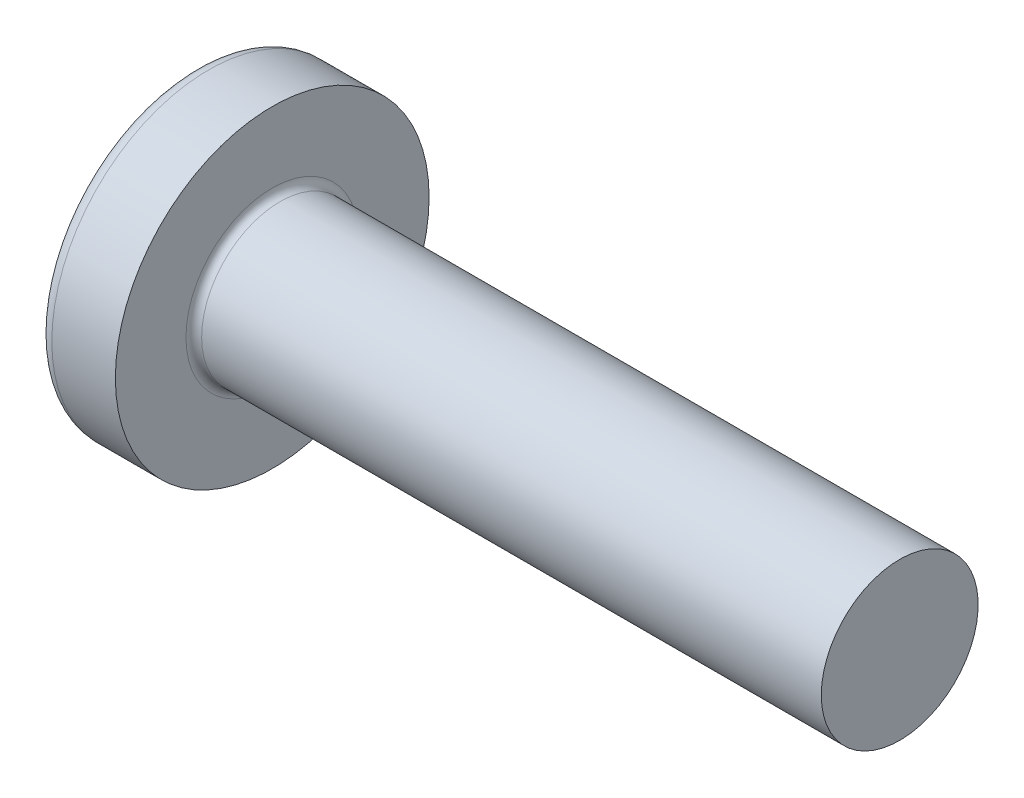
ISO-10303-21;
HEADER;
FILE_DESCRIPTION(('STEP AP214'),'2;1');
FILE_NAME('part.step','',(''),(''),'','','');
FILE_SCHEMA(('AUTOMOTIVE_DESIGN { 1 0 10303 214 1 1 1 1 }'));
ENDSEC;
DATA;
#1=APPLICATION_CONTEXT('core data for automotive mechanical design processes');
#2=APPLICATION_PROTOCOL_DEFINITION('international standard','automotive_design',2000,#1);
#3=PRODUCT_CONTEXT('',#1,'mechanical');
#4=PRODUCT('Part','Part','',(#3));
#5=PRODUCT_RELATED_PRODUCT_CATEGORY('part','',(#4));
#6=PRODUCT_DEFINITION_FORMATION('','',#4);
#7=PRODUCT_DEFINITION_CONTEXT('part definition',#1,'design');
#8=PRODUCT_DEFINITION('design','',#6,#7);
#9=PRODUCT_DEFINITION_SHAPE('','',#8);
#10=(LENGTH_UNIT() NAMED_UNIT(*) SI_UNIT(.MILLI.,.METRE.));
#11=(NAMED_UNIT(*) PLANE_ANGLE_UNIT() SI_UNIT($,.RADIAN.));
#12=(NAMED_UNIT(*) SI_UNIT($,.STERADIAN.) SOLID_ANGLE_UNIT());
#13=UNCERTAINTY_MEASURE_WITH_UNIT(LENGTH_MEASURE(1.E-05),#10,'distance_accuracy_value','');
#14=(GEOMETRIC_REPRESENTATION_CONTEXT(3) GLOBAL_UNCERTAINTY_ASSIGNED_CONTEXT((#13)) GLOBAL_UNIT_ASSIGNED_CONTEXT((#10,
#11,#12)) REPRESENTATION_CONTEXT('',''));
#15=CARTESIAN_POINT('',(0.,0.,0.));
#16=DIRECTION('',(0.,0.,1.));
#17=DIRECTION('',(1.,0.,0.));
#18=AXIS2_PLACEMENT_3D('',#15,#16,#17);
#19=CARTESIAN_POINT('',(3.2,0.,0.));
#20=DIRECTION('',(-1.,0.,0.));
#21=DIRECTION('',(0.,1.,0.));
#22=AXIS2_PLACEMENT_3D('',#19,#20,#21);
#23=SPHERICAL_SURFACE('',#22,3.2);
#24=CARTESIAN_POINT('',(0.646379599446113,0.,0.));
#25=DIRECTION('',(-1.,0.,0.));
#26=DIRECTION('',(0.,0.,1.));
#27=AXIS2_PLACEMENT_3D('',#24,#25,#26);
#28=CIRCLE('',#27,1.92847682119205);
#29=CARTESIAN_POINT('',(0.646379599446113,0.,1.92847682119205));
#30=VERTEX_POINT('',#29);
#31=EDGE_CURVE('E234',#30,#30,#28,.T.);
#32=ORIENTED_EDGE('',*,*,#31,.T.);
#33=EDGE_LOOP('',(#32));
#34=FACE_BOUND('',#33,.T.);
#35=CARTESIAN_POINT('',(0.0321614467928863,0.,0.));
#36=DIRECTION('',(1.,0.,0.));
#37=DIRECTION('',(0.,0.,-1.));
#38=AXIS2_PLACEMENT_3D('',#35,#36,#37);
#39=CIRCLE('',#38,0.452547125518057);
#40=CARTESIAN_POINT('',(0.0321614467928857,-0.239999999999999,-0.38366508938742));
#41=VERTEX_POINT('',#40);
#42=CARTESIAN_POINT('',(0.0321614467928861,-0.383665089387422,-0.24));
#43=VERTEX_POINT('',#42);
#44=EDGE_CURVE('E370',#41,#43,#39,.F.);
#45=ORIENTED_EDGE('',*,*,#44,.F.);
#46=CARTESIAN_POINT('',(3.2,-0.24,0.));
#47=DIRECTION('',(0.,1.,0.));
#48=DIRECTION('',(0.,0.,1.));
#49=AXIS2_PLACEMENT_3D('',#46,#47,#48);
#50=CIRCLE('',#49,3.19098730802866);
#51=CARTESIAN_POINT('',(0.160076670449441,-0.239999999999996,-0.970188718989376));
#52=VERTEX_POINT('',#51);
#53=EDGE_CURVE('E296',#52,#41,#50,.T.);
#54=ORIENTED_EDGE('',*,*,#53,.F.);
#55=CARTESIAN_POINT('',(2.98218770632418,0.,0.436863890831905));
#56=DIRECTION('',(0.446197800778958,0.,-0.89493436774996));
#57=DIRECTION('',(-0.89493436774996,0.,-0.446197800778958));
#58=AXIS2_PLACEMENT_3D('',#55,#56,#57);
#59=CIRCLE('',#58,3.16254766693103);
#60=CARTESIAN_POINT('',(0.160076670449441,0.240000000000003,-0.970188718989374));
#61=VERTEX_POINT('',#60);
#62=EDGE_CURVE('E268',#52,#61,#59,.T.);
#63=ORIENTED_EDGE('',*,*,#62,.T.);
#64=CARTESIAN_POINT('',(3.2,0.24,0.));
#65=DIRECTION('',(0.,-1.,0.));
#66=DIRECTION('',(0.,0.,-1.));
#67=AXIS2_PLACEMENT_3D('',#64,#65,#66);
#68=CIRCLE('',#67,3.19098730802866);
#69=CARTESIAN_POINT('',(0.0321614467928856,0.240000000000001,-0.383665089387418));
#70=VERTEX_POINT('',#69);
#71=EDGE_CURVE('E323',#70,#61,#68,.T.);
#72=ORIENTED_EDGE('',*,*,#71,.F.);
#73=CARTESIAN_POINT('',(0.0321614467928861,0.38366508938742,-0.24));
#74=VERTEX_POINT('',#73);
#75=EDGE_CURVE('E389',#74,#70,#39,.F.);
#76=ORIENTED_EDGE('',*,*,#75,.F.);
#77=CARTESIAN_POINT('',(3.2,0.,-0.24));
#78=DIRECTION('',(0.,0.,1.));
#79=DIRECTION('',(1.,0.,0.));
#80=AXIS2_PLACEMENT_3D('',#77,#78,#79);
#81=CIRCLE('',#80,3.19098730802866);
#82=CARTESIAN_POINT('',(0.160076670449441,0.970188718989374,-0.24));
#83=VERTEX_POINT('',#82);
#84=EDGE_CURVE('E262',#83,#74,#81,.T.);
#85=ORIENTED_EDGE('',*,*,#84,.F.);
#86=CARTESIAN_POINT('',(2.98218770632419,-0.436863890831905,0.));
#87=DIRECTION('',(0.446197800778958,0.89493436774996,0.));
#88=DIRECTION('',(-0.89493436774996,0.446197800778958,0.));
#89=AXIS2_PLACEMENT_3D('',#86,#87,#88);
#90=CIRCLE('',#89,3.16254766693103);
#91=CARTESIAN_POINT('',(0.160076670449442,0.970188718989374,0.24));
#92=VERTEX_POINT('',#91);
#93=EDGE_CURVE('E265',#83,#92,#90,.T.);
#94=ORIENTED_EDGE('',*,*,#93,.T.);
#95=CARTESIAN_POINT('',(3.2,0.,0.24));
#96=DIRECTION('',(0.,0.,-1.));
#97=DIRECTION('',(0.,1.,0.));
#98=AXIS2_PLACEMENT_3D('',#95,#96,#97);
#99=CIRCLE('',#98,3.19098730802866);
#100=CARTESIAN_POINT('',(0.0321614467928861,0.38366508938742,0.24));
#101=VERTEX_POINT('',#100);
#102=EDGE_CURVE('E258',#101,#92,#99,.T.);
#103=ORIENTED_EDGE('',*,*,#102,.F.);
#104=CARTESIAN_POINT('',(0.0321614467928857,0.239999999999999,0.38366508938742));
#105=VERTEX_POINT('',#104);
#106=EDGE_CURVE('E388',#105,#101,#39,.F.);
#107=ORIENTED_EDGE('',*,*,#106,.F.);
#108=CARTESIAN_POINT('',(0.160076670449441,0.239999999999997,0.970188718989375));
#109=VERTEX_POINT('',#108);
#110=EDGE_CURVE('E278',#109,#105,#68,.T.);
#111=ORIENTED_EDGE('',*,*,#110,.F.);
#112=CARTESIAN_POINT('',(2.98218770632418,0.,-0.436863890831904));
#113=DIRECTION('',(0.446197800778958,0.,0.89493436774996));
#114=DIRECTION('',(0.89493436774996,0.,-0.446197800778958));
#115=AXIS2_PLACEMENT_3D('',#112,#113,#114);
#116=CIRCLE('',#115,3.16254766693103);
#117=CARTESIAN_POINT('',(0.160076670449441,-0.240000000000003,0.970188718989374));
#118=VERTEX_POINT('',#117);
#119=EDGE_CURVE('E45',#109,#118,#116,.T.);
#120=ORIENTED_EDGE('',*,*,#119,.T.);
#121=CARTESIAN_POINT('',(0.0321614467928858,-0.240000000000001,0.383665089387418));
#122=VERTEX_POINT('',#121);
#123=EDGE_CURVE('E275',#122,#118,#50,.T.);
#124=ORIENTED_EDGE('',*,*,#123,.F.);
#125=CARTESIAN_POINT('',(0.0321614467928861,-0.383665089387422,0.24));
#126=VERTEX_POINT('',#125);
#127=EDGE_CURVE('E424',#126,#122,#39,.F.);
#128=ORIENTED_EDGE('',*,*,#127,.F.);
#129=CARTESIAN_POINT('',(0.160076670449441,-0.970188718989375,0.24));
#130=VERTEX_POINT('',#129);
#131=EDGE_CURVE('E259',#130,#126,#99,.T.);
#132=ORIENTED_EDGE('',*,*,#131,.F.);
#133=CARTESIAN_POINT('',(2.98218770632418,0.436863890831904,0.));
#134=DIRECTION('',(0.446197800778958,-0.89493436774996,0.));
#135=DIRECTION('',(0.89493436774996,0.446197800778958,0.));
#136=AXIS2_PLACEMENT_3D('',#133,#134,#135);
#137=CIRCLE('',#136,3.16254766693103);
#138=CARTESIAN_POINT('',(0.160076670449441,-0.970188718989375,-0.24));
#139=VERTEX_POINT('',#138);
#140=EDGE_CURVE('E255',#130,#139,#137,.T.);
#141=ORIENTED_EDGE('',*,*,#140,.T.);
#142=EDGE_CURVE('E60',#43,#139,#81,.T.);
#143=ORIENTED_EDGE('',*,*,#142,.F.);
#144=EDGE_LOOP('',(#45,#54,#63,#72,#76,#85,#94,#103,#107,#111,#120,#124,#128,#132,#141,#143));
#145=FACE_BOUND('',#144,.T.);
#146=ADVANCED_FACE('F32',(#34,#145),#23,.T.);
#147=CARTESIAN_POINT('',(1.42,0.342014140993248,-0.24));
#148=DIRECTION('',(0.,0.,1.));
#149=DIRECTION('',(1.,0.,0.));
#150=AXIS2_PLACEMENT_3D('',#147,#148,#149);
#151=PLANE('',#150);
#152=ORIENTED_EDGE('',*,*,#84,.T.);
#153=CARTESIAN_POINT('',(-0.626811087646333,0.437068483432734,-0.24));
#154=CARTESIAN_POINT('',(-0.489788496188268,0.426133650699674,-0.24));
#155=CARTESIAN_POINT('',(-0.35277275089666,0.415111501640762,-0.24));
#156=CARTESIAN_POINT('',(-0.078757882964478,0.392826208775377,-0.24));
#157=CARTESIAN_POINT('',(0.0582412392502161,0.381563059737591,-0.24));
#158=CARTESIAN_POINT('',(0.332213907654152,0.358729879929546,-0.24));
#159=CARTESIAN_POINT('',(0.469187453856035,0.347159849311357,-0.24));
#160=CARTESIAN_POINT('',(0.743097225439297,0.323608060039765,-0.24));
#161=CARTESIAN_POINT('',(0.880033451350377,0.311626307573655,-0.24));
#162=CARTESIAN_POINT('',(1.12503843743479,0.289667437089413,-0.24));
#163=CARTESIAN_POINT('',(1.23311691792,0.279799173776849,-0.24));
#164=CARTESIAN_POINT('',(1.4492267018282,0.259570129968442,-0.24));
#165=CARTESIAN_POINT('',(1.55725800577256,0.249209355061897,-0.24));
#166=CARTESIAN_POINT('',(1.77325939831777,0.227783788850472,-0.24));
#167=CARTESIAN_POINT('',(1.88122948205844,0.216718947894398,-0.24));
#168=CARTESIAN_POINT('',(2.04309848476113,0.199296215271932,-0.24));
#169=CARTESIAN_POINT('',(2.09704158415864,0.193350927204474,-0.24));
#170=CARTESIAN_POINT('',(2.20488609252136,0.181086542764125,-0.24));
#171=CARTESIAN_POINT('',(2.25878750075649,0.174767439988846,-0.24));
#172=CARTESIAN_POINT('',(2.31266102213859,0.168212174791089,-0.24));
#173=B_SPLINE_CURVE_WITH_KNOTS('',3,(#153,#154,#155,#156,#157,#158,#159,#160,#161,#162,#163,
#164,#165,#166,#167,#168,#169,#170,#171,#172),.UNSPECIFIED.,.F.,.F.,(4,2,2,2,2,2,2,2,2,4),(0.,
0.412374804430943,0.824758569256476,1.23714212973639,1.64951949568622,1.97510284899868,
2.30068250829037,2.62628515317116,2.78909323564388,2.95190410736571),.UNSPECIFIED.);
#174=CARTESIAN_POINT('',(1.42,0.262259890185289,-0.240000000000001));
#175=VERTEX_POINT('',#174);
#176=EDGE_CURVE('E410',#74,#175,#173,.T.);
#177=ORIENTED_EDGE('',*,*,#176,.T.);
#178=DIRECTION('',(0.,1.,0.));
#179=VECTOR('',#178,1.);
#180=CARTESIAN_POINT('',(1.42,-0.342014140993248,-0.24));
#181=LINE('',#180,#179);
#182=CARTESIAN_POINT('',(1.42,0.342014140993248,-0.24));
#183=VERTEX_POINT('',#182);
#184=EDGE_CURVE('E352',#175,#183,#181,.T.);
#185=ORIENTED_EDGE('',*,*,#184,.T.);
#186=DIRECTION('',(0.89493436774996,-0.446197800778958,0.));
#187=VECTOR('',#186,1.);
#188=CARTESIAN_POINT('',(0.,1.05,-0.24));
#189=LINE('',#188,#187);
#190=EDGE_CURVE('E235',#83,#183,#189,.T.);
#191=ORIENTED_EDGE('',*,*,#190,.F.);
#192=EDGE_LOOP('',(#152,#177,#185,#191));
#193=FACE_BOUND('',#192,.T.);
#194=ADVANCED_FACE('F190',(#193),#151,.T.);
#195=CARTESIAN_POINT('',(1.42,-0.342014140993248,-0.24));
#196=VERTEX_POINT('',#195);
#197=CARTESIAN_POINT('',(1.42,-0.262259890185289,-0.240000000000001));
#198=VERTEX_POINT('',#197);
#199=EDGE_CURVE('E243',#196,#198,#181,.T.);
#200=ORIENTED_EDGE('',*,*,#199,.T.);
#201=CARTESIAN_POINT('',(-0.626811087646333,-0.437068483432734,-0.24));
#202=CARTESIAN_POINT('',(-0.489788496188268,-0.426133650699674,-0.24));
#203=CARTESIAN_POINT('',(-0.35277275089666,-0.415111501640762,-0.24));
#204=CARTESIAN_POINT('',(-0.078757882964478,-0.392826208775377,-0.24));
#205=CARTESIAN_POINT('',(0.0582412392502161,-0.381563059737591,-0.24));
#206=CARTESIAN_POINT('',(0.332213907654152,-0.358729879929546,-0.24));
#207=CARTESIAN_POINT('',(0.469187453856035,-0.347159849311357,-0.24));
#208=CARTESIAN_POINT('',(0.743097225439297,-0.323608060039765,-0.24));
#209=CARTESIAN_POINT('',(0.880033451350377,-0.311626307573655,-0.24));
#210=CARTESIAN_POINT('',(1.12503843743479,-0.289667437089413,-0.24));
#211=CARTESIAN_POINT('',(1.23311691792,-0.279799173776849,-0.24));
#212=CARTESIAN_POINT('',(1.4492267018282,-0.259570129968442,-0.24));
#213=CARTESIAN_POINT('',(1.55725800577256,-0.249209355061897,-0.24));
#214=CARTESIAN_POINT('',(1.77325939831777,-0.227783788850472,-0.24));
#215=CARTESIAN_POINT('',(1.88122948205844,-0.216718947894398,-0.24));
#216=CARTESIAN_POINT('',(2.04309848476113,-0.199296215271932,-0.24));
#217=CARTESIAN_POINT('',(2.09704158415864,-0.193350927204474,-0.24));
#218=CARTESIAN_POINT('',(2.20488609252136,-0.181086542764125,-0.24));
#219=CARTESIAN_POINT('',(2.25878750075649,-0.174767439988846,-0.24));
#220=CARTESIAN_POINT('',(2.31266102213859,-0.168212174791089,-0.24));
#221=B_SPLINE_CURVE_WITH_KNOTS('',3,(#201,#202,#203,#204,#205,#206,#207,#208,#209,#210,#211,
#212,#213,#214,#215,#216,#217,#218,#219,#220),.UNSPECIFIED.,.F.,.F.,(4,2,2,2,2,2,2,2,2,4),(0.,
0.412374804430943,0.824758569256476,1.23714212973639,1.64951949568622,1.97510284899868,
2.30068250829037,2.62628515317116,2.78909323564388,2.95190410736571),.UNSPECIFIED.);
#222=EDGE_CURVE('E387',#198,#43,#221,.F.);
#223=ORIENTED_EDGE('',*,*,#222,.T.);
#224=ORIENTED_EDGE('',*,*,#142,.T.);
#225=DIRECTION('',(0.89493436774996,0.446197800778958,0.));
#226=VECTOR('',#225,1.);
#227=CARTESIAN_POINT('',(0.,-1.05,-0.24));
#228=LINE('',#227,#226);
#229=EDGE_CURVE('E326',#139,#196,#228,.T.);
#230=ORIENTED_EDGE('',*,*,#229,.T.);
#231=EDGE_LOOP('',(#200,#223,#224,#230));
#232=FACE_BOUND('',#231,.T.);
#233=ADVANCED_FACE('F196',(#232),#151,.T.);
#234=CARTESIAN_POINT('',(1.42,-0.342014140993248,0.24));
#235=DIRECTION('',(0.,0.,-1.));
#236=DIRECTION('',(0.,1.,0.));
#237=AXIS2_PLACEMENT_3D('',#234,#235,#236);
#238=PLANE('',#237);
#239=DIRECTION('',(0.,-1.,0.));
#240=VECTOR('',#239,1.);
#241=CARTESIAN_POINT('',(1.42,0.342014140993248,0.24));
#242=LINE('',#241,#240);
#243=CARTESIAN_POINT('',(1.42,0.342014140993248,0.24));
#244=VERTEX_POINT('',#243);
#245=CARTESIAN_POINT('',(1.42,0.262259890185289,0.240000000000001));
#246=VERTEX_POINT('',#245);
#247=EDGE_CURVE('E335',#244,#246,#242,.T.);
#248=ORIENTED_EDGE('',*,*,#247,.T.);
#249=CARTESIAN_POINT('',(-0.626811087646333,0.437068483432734,0.24));
#250=CARTESIAN_POINT('',(-0.489788496188268,0.426133650699674,0.24));
#251=CARTESIAN_POINT('',(-0.35277275089666,0.415111501640762,0.24));
#252=CARTESIAN_POINT('',(-0.078757882964478,0.392826208775377,0.24));
#253=CARTESIAN_POINT('',(0.0582412392502161,0.381563059737591,0.24));
#254=CARTESIAN_POINT('',(0.332213907654152,0.358729879929546,0.24));
#255=CARTESIAN_POINT('',(0.469187453856035,0.347159849311357,0.24));
#256=CARTESIAN_POINT('',(0.743097225439297,0.323608060039765,0.24));
#257=CARTESIAN_POINT('',(0.880033451350377,0.311626307573655,0.24));
#258=CARTESIAN_POINT('',(1.12503843743479,0.289667437089413,0.24));
#259=CARTESIAN_POINT('',(1.23311691792,0.279799173776849,0.24));
#260=CARTESIAN_POINT('',(1.4492267018282,0.259570129968442,0.24));
#261=CARTESIAN_POINT('',(1.55725800577256,0.249209355061897,0.24));
#262=CARTESIAN_POINT('',(1.77325939831777,0.227783788850472,0.24));
#263=CARTESIAN_POINT('',(1.88122948205844,0.216718947894398,0.24));
#264=CARTESIAN_POINT('',(2.04309848476113,0.199296215271932,0.24));
#265=CARTESIAN_POINT('',(2.09704158415864,0.193350927204474,0.24));
#266=CARTESIAN_POINT('',(2.20488609252136,0.181086542764125,0.24));
#267=CARTESIAN_POINT('',(2.25878750075649,0.174767439988846,0.24));
#268=CARTESIAN_POINT('',(2.31266102213859,0.168212174791089,0.24));
#269=B_SPLINE_CURVE_WITH_KNOTS('',3,(#249,#250,#251,#252,#253,#254,#255,#256,#257,#258,#259,
#260,#261,#262,#263,#264,#265,#266,#267,#268),.UNSPECIFIED.,.F.,.F.,(4,2,2,2,2,2,2,2,2,4),(0.,
0.412374804430943,0.824758569256476,1.23714212973639,1.64951949568622,1.97510284899868,
2.30068250829037,2.62628515317116,2.78909323564388,2.95190410736571),.UNSPECIFIED.);
#270=EDGE_CURVE('E668',#246,#101,#269,.F.);
#271=ORIENTED_EDGE('',*,*,#270,.T.);
#272=ORIENTED_EDGE('',*,*,#102,.T.);
#273=DIRECTION('',(0.89493436774996,-0.446197800778958,0.));
#274=VECTOR('',#273,1.);
#275=CARTESIAN_POINT('',(0.,1.05,0.24));
#276=LINE('',#275,#274);
#277=EDGE_CURVE('E240',#92,#244,#276,.T.);
#278=ORIENTED_EDGE('',*,*,#277,.T.);
#279=EDGE_LOOP('',(#248,#271,#272,#278));
#280=FACE_BOUND('',#279,.T.);
#281=ADVANCED_FACE('F406',(#280),#238,.T.);
#282=ORIENTED_EDGE('',*,*,#131,.T.);
#283=CARTESIAN_POINT('',(-0.62681108769363,-0.437068483436507,0.24));
#284=CARTESIAN_POINT('',(-0.489788496230297,-0.426133650703048,0.24));
#285=CARTESIAN_POINT('',(-0.352772750933422,-0.415111501643733,0.24));
#286=CARTESIAN_POINT('',(-0.078757882990706,-0.392826208777529,0.24));
#287=CARTESIAN_POINT('',(0.0582412392292549,-0.381563059739326,0.24));
#288=CARTESIAN_POINT('',(0.332213907649304,-0.358729879929962,0.24));
#289=CARTESIAN_POINT('',(0.46918745386203,-0.347159849310859,0.24));
#290=CARTESIAN_POINT('',(0.743097225466975,-0.323608060037368,0.24));
#291=CARTESIAN_POINT('',(0.880033451388893,-0.311626307570274,0.24));
#292=CARTESIAN_POINT('',(1.12503843748414,-0.289667437084935,0.24));
#293=CARTESIAN_POINT('',(1.23311691796934,-0.279799173772307,0.24));
#294=CARTESIAN_POINT('',(1.44922670187753,-0.259570129963748,0.24));
#295=CARTESIAN_POINT('',(1.55725800582188,-0.249209355057115,0.24));
#296=CARTESIAN_POINT('',(1.77325939836707,-0.227783788845471,0.24));
#297=CARTESIAN_POINT('',(1.88122948210773,-0.216718947889267,0.24));
#298=CARTESIAN_POINT('',(2.0430984848104,-0.199296215266543,0.24));
#299=CARTESIAN_POINT('',(2.0970415842079,-0.193350927198989,0.24));
#300=CARTESIAN_POINT('',(2.20488609257059,-0.181086542758414,0.24));
#301=CARTESIAN_POINT('',(2.25878750080571,-0.174767439983005,0.24));
#302=CARTESIAN_POINT('',(2.31266102218779,-0.168212174785095,0.24));
#303=B_SPLINE_CURVE_WITH_KNOTS('',3,(#283,#284,#285,#286,#287,#288,#289,#290,#291,#292,#293,
#294,#295,#296,#297,#298,#299,#300,#301,#302),.UNSPECIFIED.,.F.,.F.,(4,2,2,2,2,2,2,2,2,4),(0.,
0.41237480444679,0.824758569288173,1.23714212980074,1.64951949578321,1.97510284909568,
2.30068250838736,2.62628515326816,2.78909323574088,2.95190410746272),.UNSPECIFIED.);
#304=CARTESIAN_POINT('',(1.42,-0.262259890185289,0.240000000000001));
#305=VERTEX_POINT('',#304);
#306=EDGE_CURVE('E425',#126,#305,#303,.T.);
#307=ORIENTED_EDGE('',*,*,#306,.T.);
#308=CARTESIAN_POINT('',(1.42,-0.342014140993248,0.24));
#309=VERTEX_POINT('',#308);
#310=EDGE_CURVE('E337',#305,#309,#242,.T.);
#311=ORIENTED_EDGE('',*,*,#310,.T.);
#312=DIRECTION('',(0.89493436774996,0.446197800778958,0.));
#313=VECTOR('',#312,1.);
#314=CARTESIAN_POINT('',(0.,-1.05,0.24));
#315=LINE('',#314,#313);
#316=EDGE_CURVE('E328',#130,#309,#315,.T.);
#317=ORIENTED_EDGE('',*,*,#316,.F.);
#318=EDGE_LOOP('',(#282,#307,#311,#317));
#319=FACE_BOUND('',#318,.T.);
#320=ADVANCED_FACE('F516',(#319),#238,.T.);
#321=CARTESIAN_POINT('',(1.42,0.342014140993248,0.24));
#322=DIRECTION('',(0.446197800778958,0.89493436774996,0.));
#323=DIRECTION('',(-0.89493436774996,0.446197800778958,0.));
#324=AXIS2_PLACEMENT_3D('',#321,#322,#323);
#325=PLANE('',#324);
#326=CARTESIAN_POINT('',(2.01772939130752,0.0439972701774458,0.));
#327=DIRECTION('',(0.446197800778958,0.89493436774996,0.));
#328=DIRECTION('',(-0.89493436774996,0.446197800778958,0.));
#329=AXIS2_PLACEMENT_3D('',#326,#327,#328);
#330=ELLIPSE('',#329,0.703057452800713,0.310602024247227);
#331=CARTESIAN_POINT('',(1.42,0.342014140993249,0.0969875113643495));
#332=VERTEX_POINT('',#331);
#333=CARTESIAN_POINT('',(1.42,0.342014140993249,-0.0969875113643495));
#334=VERTEX_POINT('',#333);
#335=EDGE_CURVE('E301',#332,#334,#330,.F.);
#336=ORIENTED_EDGE('',*,*,#335,.F.);
#337=DIRECTION('',(0.,0.,-1.));
#338=VECTOR('',#337,1.);
#339=CARTESIAN_POINT('',(1.42,0.342014140993248,0.24));
#340=LINE('',#339,#338);
#341=EDGE_CURVE('E338',#244,#332,#340,.T.);
#342=ORIENTED_EDGE('',*,*,#341,.F.);
#343=ORIENTED_EDGE('',*,*,#277,.F.);
#344=ORIENTED_EDGE('',*,*,#93,.F.);
#345=ORIENTED_EDGE('',*,*,#190,.T.);
#346=EDGE_CURVE('E340',#334,#183,#340,.T.);
#347=ORIENTED_EDGE('',*,*,#346,.F.);
#348=EDGE_LOOP('',(#336,#342,#343,#344,#345,#347));
#349=FACE_BOUND('',#348,.T.);
#350=ADVANCED_FACE('F404',(#349),#325,.F.);
#351=CARTESIAN_POINT('',(0.,-1.05,-0.24));
#352=DIRECTION('',(0.446197800778958,-0.89493436774996,0.));
#353=DIRECTION('',(0.89493436774996,0.446197800778958,0.));
#354=AXIS2_PLACEMENT_3D('',#351,#352,#353);
#355=PLANE('',#354);
#356=CARTESIAN_POINT('',(2.01772939130752,-0.0439972701774458,0.));
#357=DIRECTION('',(0.446197800778958,-0.89493436774996,0.));
#358=DIRECTION('',(-0.89493436774996,-0.446197800778958,0.));
#359=AXIS2_PLACEMENT_3D('',#356,#357,#358);
#360=ELLIPSE('',#359,0.703057452800713,0.310602024247227);
#361=CARTESIAN_POINT('',(1.42,-0.342014140993249,-0.0969875113643494));
#362=VERTEX_POINT('',#361);
#363=CARTESIAN_POINT('',(1.42,-0.342014140993249,0.0969875113643493));
#364=VERTEX_POINT('',#363);
#365=EDGE_CURVE('E670',#362,#364,#360,.F.);
#366=ORIENTED_EDGE('',*,*,#365,.F.);
#367=DIRECTION('',(0.,0.,1.));
#368=VECTOR('',#367,1.);
#369=CARTESIAN_POINT('',(1.42,-0.342014140993248,-0.24));
#370=LINE('',#369,#368);
#371=EDGE_CURVE('E331',#196,#362,#370,.T.);
#372=ORIENTED_EDGE('',*,*,#371,.F.);
#373=ORIENTED_EDGE('',*,*,#229,.F.);
#374=ORIENTED_EDGE('',*,*,#140,.F.);
#375=ORIENTED_EDGE('',*,*,#316,.T.);
#376=EDGE_CURVE('E334',#364,#309,#370,.T.);
#377=ORIENTED_EDGE('',*,*,#376,.F.);
#378=EDGE_LOOP('',(#366,#372,#373,#374,#375,#377));
#379=FACE_BOUND('',#378,.T.);
#380=ADVANCED_FACE('F503',(#379),#355,.F.);
#381=CARTESIAN_POINT('',(1.42,0.342014140993248,-0.24));
#382=DIRECTION('',(-1.,0.,0.));
#383=DIRECTION('',(0.,0.,1.));
#384=AXIS2_PLACEMENT_3D('',#381,#382,#383);
#385=PLANE('',#384);
#386=DIRECTION('',(0.,1.,0.));
#387=VECTOR('',#386,1.);
#388=CARTESIAN_POINT('',(1.42,-0.240000000000001,0.342014140993247));
#389=LINE('',#388,#387);
#390=CARTESIAN_POINT('',(1.42,-0.240000000000001,0.342014140993247));
#391=VERTEX_POINT('',#390);
#392=CARTESIAN_POINT('',(1.42,-0.0969875113643545,0.342014140993248));
#393=VERTEX_POINT('',#392);
#394=EDGE_CURVE('E316',#391,#393,#389,.T.);
#395=ORIENTED_EDGE('',*,*,#394,.T.);
#396=CARTESIAN_POINT('',(1.42,0.,0.));
#397=DIRECTION('',(-1.,0.,0.));
#398=DIRECTION('',(0.,0.,1.));
#399=AXIS2_PLACEMENT_3D('',#396,#397,#398);
#400=CIRCLE('',#399,0.3555);
#401=CARTESIAN_POINT('',(1.42,-0.240000000000001,0.262259890185289));
#402=VERTEX_POINT('',#401);
#403=EDGE_CURVE('E696',#402,#393,#400,.T.);
#404=ORIENTED_EDGE('',*,*,#403,.F.);
#405=DIRECTION('',(0.,0.,-1.));
#406=VECTOR('',#405,1.);
#407=CARTESIAN_POINT('',(1.42,-0.240000000000001,0.342014140993247));
#408=LINE('',#407,#406);
#409=EDGE_CURVE('E312',#391,#402,#408,.T.);
#410=ORIENTED_EDGE('',*,*,#409,.F.);
#411=EDGE_LOOP('',(#395,#404,#410));
#412=FACE_BOUND('',#411,.T.);
#413=ADVANCED_FACE('F460',(#412),#385,.T.);
#414=ORIENTED_EDGE('',*,*,#310,.F.);
#415=EDGE_CURVE('E701',#364,#305,#400,.T.);
#416=ORIENTED_EDGE('',*,*,#415,.F.);
#417=ORIENTED_EDGE('',*,*,#376,.T.);
#418=EDGE_LOOP('',(#414,#416,#417));
#419=FACE_BOUND('',#418,.T.);
#420=ADVANCED_FACE('F490',(#419),#385,.T.);
#421=ORIENTED_EDGE('',*,*,#371,.T.);
#422=EDGE_CURVE('E381',#198,#362,#400,.T.);
#423=ORIENTED_EDGE('',*,*,#422,.F.);
#424=ORIENTED_EDGE('',*,*,#199,.F.);
#425=EDGE_LOOP('',(#421,#423,#424));
#426=FACE_BOUND('',#425,.T.);
#427=ADVANCED_FACE('F484',(#426),#385,.T.);
#428=CARTESIAN_POINT('',(1.42,-0.239999999999999,-0.262259890185288));
#429=VERTEX_POINT('',#428);
#430=CARTESIAN_POINT('',(1.42,-0.239999999999999,-0.342014140993249));
#431=VERTEX_POINT('',#430);
#432=EDGE_CURVE('E315',#429,#431,#408,.T.);
#433=ORIENTED_EDGE('',*,*,#432,.F.);
#434=CARTESIAN_POINT('',(1.42,-0.0969875113643523,-0.342014140993248));
#435=VERTEX_POINT('',#434);
#436=EDGE_CURVE('E52',#435,#429,#400,.T.);
#437=ORIENTED_EDGE('',*,*,#436,.F.);
#438=DIRECTION('',(0.,-1.,0.));
#439=VECTOR('',#438,1.);
#440=CARTESIAN_POINT('',(1.42,0.240000000000001,-0.342014140993247));
#441=LINE('',#440,#439);
#442=EDGE_CURVE('E311',#435,#431,#441,.T.);
#443=ORIENTED_EDGE('',*,*,#442,.T.);
#444=EDGE_LOOP('',(#433,#437,#443));
#445=FACE_BOUND('',#444,.T.);
#446=ADVANCED_FACE('F376',(#445),#385,.T.);
#447=CARTESIAN_POINT('',(1.42,0.240000000000001,-0.342014140993247));
#448=VERTEX_POINT('',#447);
#449=CARTESIAN_POINT('',(1.42,0.0969875113643547,-0.342014140993248));
#450=VERTEX_POINT('',#449);
#451=EDGE_CURVE('E308',#448,#450,#441,.T.);
#452=ORIENTED_EDGE('',*,*,#451,.T.);
#453=CARTESIAN_POINT('',(1.42,0.240000000000001,-0.262259890185289));
#454=VERTEX_POINT('',#453);
#455=EDGE_CURVE('E380',#454,#450,#400,.T.);
#456=ORIENTED_EDGE('',*,*,#455,.F.);
#457=DIRECTION('',(0.,0.,1.));
#458=VECTOR('',#457,1.);
#459=CARTESIAN_POINT('',(1.42,0.240000000000001,-0.342014140993247));
#460=LINE('',#459,#458);
#461=EDGE_CURVE('E320',#448,#454,#460,.T.);
#462=ORIENTED_EDGE('',*,*,#461,.F.);
#463=EDGE_LOOP('',(#452,#456,#462));
#464=FACE_BOUND('',#463,.T.);
#465=ADVANCED_FACE('F472',(#464),#385,.T.);
#466=ORIENTED_EDGE('',*,*,#184,.F.);
#467=EDGE_CURVE('E685',#334,#175,#400,.T.);
#468=ORIENTED_EDGE('',*,*,#467,.F.);
#469=ORIENTED_EDGE('',*,*,#346,.T.);
#470=EDGE_LOOP('',(#466,#468,#469));
#471=FACE_BOUND('',#470,.T.);
#472=ADVANCED_FACE('F466',(#471),#385,.T.);
#473=ORIENTED_EDGE('',*,*,#341,.T.);
#474=EDGE_CURVE('E687',#246,#332,#400,.T.);
#475=ORIENTED_EDGE('',*,*,#474,.F.);
#476=ORIENTED_EDGE('',*,*,#247,.F.);
#477=EDGE_LOOP('',(#473,#475,#476));
#478=FACE_BOUND('',#477,.T.);
#479=ADVANCED_FACE('F458',(#478),#385,.T.);
#480=CARTESIAN_POINT('',(1.42,0.239999999999999,0.26225989018529));
#481=VERTEX_POINT('',#480);
#482=CARTESIAN_POINT('',(1.42,0.239999999999999,0.342014140993249));
#483=VERTEX_POINT('',#482);
#484=EDGE_CURVE('E293',#481,#483,#460,.T.);
#485=ORIENTED_EDGE('',*,*,#484,.F.);
#486=CARTESIAN_POINT('',(1.42,0.0969875113643521,0.342014140993249));
#487=VERTEX_POINT('',#486);
#488=EDGE_CURVE('E382',#487,#481,#400,.T.);
#489=ORIENTED_EDGE('',*,*,#488,.F.);
#490=EDGE_CURVE('E319',#487,#483,#389,.T.);
#491=ORIENTED_EDGE('',*,*,#490,.T.);
#492=EDGE_LOOP('',(#485,#489,#491));
#493=FACE_BOUND('',#492,.T.);
#494=ADVANCED_FACE('F452',(#493),#385,.T.);
#495=CARTESIAN_POINT('',(1.42,0.239999999999999,0.342014140993249));
#496=DIRECTION('',(0.,-1.,0.));
#497=DIRECTION('',(1.,0.,0.));
#498=AXIS2_PLACEMENT_3D('',#495,#496,#497);
#499=PLANE('',#498);
#500=ORIENTED_EDGE('',*,*,#110,.T.);
#501=CARTESIAN_POINT('',(-0.626811087646333,0.239999999999998,0.437068483432735));
#502=CARTESIAN_POINT('',(-0.489788496188268,0.239999999999999,0.426133650699675));
#503=CARTESIAN_POINT('',(-0.35277275089666,0.239999999999999,0.415111501640762));
#504=CARTESIAN_POINT('',(-0.0787578829644782,0.239999999999999,0.392826208775378));
#505=CARTESIAN_POINT('',(0.0582412392502159,0.239999999999999,0.381563059737592));
#506=CARTESIAN_POINT('',(0.332213907654153,0.239999999999999,0.358729879929547));
#507=CARTESIAN_POINT('',(0.469187453856035,0.239999999999999,0.347159849311358));
#508=CARTESIAN_POINT('',(0.743097225439297,0.239999999999999,0.323608060039766));
#509=CARTESIAN_POINT('',(0.880033451350377,0.239999999999999,0.311626307573656));
#510=CARTESIAN_POINT('',(1.12503843743479,0.239999999999999,0.289667437089414));
#511=CARTESIAN_POINT('',(1.23311691792,0.239999999999999,0.279799173776849));
#512=CARTESIAN_POINT('',(1.4492267018282,0.239999999999999,0.259570129968443));
#513=CARTESIAN_POINT('',(1.55725800577256,0.239999999999999,0.249209355061898));
#514=CARTESIAN_POINT('',(1.77325939831777,0.239999999999999,0.227783788850473));
#515=CARTESIAN_POINT('',(1.88122948205844,0.239999999999999,0.216718947894399));
#516=CARTESIAN_POINT('',(2.04309848476113,0.239999999999999,0.199296215271933));
#517=CARTESIAN_POINT('',(2.09704158415864,0.239999999999999,0.193350927204475));
#518=CARTESIAN_POINT('',(2.20488609252136,0.239999999999999,0.181086542764126));
#519=CARTESIAN_POINT('',(2.25878750075649,0.239999999999999,0.174767439988847));
#520=CARTESIAN_POINT('',(2.31266102213859,0.239999999999999,0.16821217479109));
#521=B_SPLINE_CURVE_WITH_KNOTS('',3,(#501,#502,#503,#504,#505,#506,#507,#508,#509,#510,#511,
#512,#513,#514,#515,#516,#517,#518,#519,#520),.UNSPECIFIED.,.F.,.F.,(4,2,2,2,2,2,2,2,2,4),(0.,
0.412374804430942,0.824758569256476,1.23714212973639,1.64951949568622,1.97510284899868,
2.30068250829037,2.62628515317116,2.78909323564388,2.95190410736571),.UNSPECIFIED.);
#522=EDGE_CURVE('E667',#105,#481,#521,.T.);
#523=ORIENTED_EDGE('',*,*,#522,.T.);
#524=ORIENTED_EDGE('',*,*,#484,.T.);
#525=DIRECTION('',(0.89493436774996,0.,-0.446197800778958));
#526=VECTOR('',#525,1.);
#527=CARTESIAN_POINT('',(0.,0.239999999999996,1.05));
#528=LINE('',#527,#526);
#529=EDGE_CURVE('E286',#109,#483,#528,.T.);
#530=ORIENTED_EDGE('',*,*,#529,.F.);
#531=EDGE_LOOP('',(#500,#523,#524,#530));
#532=FACE_BOUND('',#531,.T.);
#533=ADVANCED_FACE('F290',(#532),#499,.T.);
#534=CARTESIAN_POINT('',(1.42,-0.239999999999999,-0.342014140993249));
#535=DIRECTION('',(0.,1.,0.));
#536=DIRECTION('',(0.,0.,1.));
#537=AXIS2_PLACEMENT_3D('',#534,#535,#536);
#538=PLANE('',#537);
#539=ORIENTED_EDGE('',*,*,#409,.T.);
#540=CARTESIAN_POINT('',(-0.626811087646334,-0.240000000000002,0.437068483432733));
#541=CARTESIAN_POINT('',(-0.489788496188268,-0.240000000000001,0.426133650699673));
#542=CARTESIAN_POINT('',(-0.35277275089666,-0.240000000000001,0.415111501640761));
#543=CARTESIAN_POINT('',(-0.0787578829644779,-0.240000000000001,0.392826208775376));
#544=CARTESIAN_POINT('',(0.0582412392502161,-0.240000000000001,0.38156305973759));
#545=CARTESIAN_POINT('',(0.332213907654152,-0.240000000000001,0.358729879929545));
#546=CARTESIAN_POINT('',(0.469187453856034,-0.240000000000001,0.347159849311357));
#547=CARTESIAN_POINT('',(0.743097225439297,-0.240000000000001,0.323608060039764));
#548=CARTESIAN_POINT('',(0.880033451350377,-0.240000000000001,0.311626307573654));
#549=CARTESIAN_POINT('',(1.12503843743479,-0.240000000000001,0.289667437089413));
#550=CARTESIAN_POINT('',(1.23311691792,-0.240000000000001,0.279799173776848));
#551=CARTESIAN_POINT('',(1.4492267018282,-0.240000000000001,0.259570129968441));
#552=CARTESIAN_POINT('',(1.55725800577256,-0.240000000000001,0.249209355061896));
#553=CARTESIAN_POINT('',(1.77325939831777,-0.240000000000001,0.227783788850472));
#554=CARTESIAN_POINT('',(1.88122948205844,-0.240000000000001,0.216718947894398));
#555=CARTESIAN_POINT('',(2.04309848476113,-0.240000000000001,0.199296215271931));
#556=CARTESIAN_POINT('',(2.09704158415864,-0.240000000000001,0.193350927204474));
#557=CARTESIAN_POINT('',(2.20488609252136,-0.240000000000001,0.181086542764124));
#558=CARTESIAN_POINT('',(2.25878750075649,-0.240000000000001,0.174767439988845));
#559=CARTESIAN_POINT('',(2.31266102213859,-0.240000000000001,0.168212174791088));
#560=B_SPLINE_CURVE_WITH_KNOTS('',3,(#540,#541,#542,#543,#544,#545,#546,#547,#548,#549,#550,
#551,#552,#553,#554,#555,#556,#557,#558,#559),.UNSPECIFIED.,.F.,.F.,(4,2,2,2,2,2,2,2,2,4),(0.,
0.412374804430943,0.824758569256476,1.23714212973639,1.64951949568622,1.97510284899868,
2.30068250829037,2.62628515317116,2.78909323564388,2.95190410736571),.UNSPECIFIED.);
#561=EDGE_CURVE('E418',#402,#122,#560,.F.);
#562=ORIENTED_EDGE('',*,*,#561,.T.);
#563=ORIENTED_EDGE('',*,*,#123,.T.);
#564=DIRECTION('',(0.89493436774996,0.,-0.446197800778958));
#565=VECTOR('',#564,1.);
#566=CARTESIAN_POINT('',(0.,-0.240000000000004,1.05));
#567=LINE('',#566,#565);
#568=EDGE_CURVE('E288',#118,#391,#567,.T.);
#569=ORIENTED_EDGE('',*,*,#568,.T.);
#570=EDGE_LOOP('',(#539,#562,#563,#569));
#571=FACE_BOUND('',#570,.T.);
#572=ADVANCED_FACE('F225',(#571),#538,.T.);
#573=CARTESIAN_POINT('',(1.42,-0.240000000000001,0.342014140993247));
#574=DIRECTION('',(0.446197800778958,0.,0.89493436774996));
#575=DIRECTION('',(-0.89493436774996,0.,0.446197800778958));
#576=AXIS2_PLACEMENT_3D('',#573,#574,#575);
#577=PLANE('',#576);
#578=CARTESIAN_POINT('',(2.01772939130752,0.,0.0439972701774458));
#579=DIRECTION('',(0.446197800778958,0.,0.89493436774996));
#580=DIRECTION('',(-0.89493436774996,0.,0.446197800778958));
#581=AXIS2_PLACEMENT_3D('',#578,#579,#580);
#582=ELLIPSE('',#581,0.703057452800713,0.310602024247227);
#583=EDGE_CURVE('E416',#393,#487,#582,.F.);
#584=ORIENTED_EDGE('',*,*,#583,.F.);
#585=ORIENTED_EDGE('',*,*,#394,.F.);
#586=ORIENTED_EDGE('',*,*,#568,.F.);
#587=ORIENTED_EDGE('',*,*,#119,.F.);
#588=ORIENTED_EDGE('',*,*,#529,.T.);
#589=ORIENTED_EDGE('',*,*,#490,.F.);
#590=EDGE_LOOP('',(#584,#585,#586,#587,#588,#589));
#591=FACE_BOUND('',#590,.T.);
#592=ADVANCED_FACE('F284',(#591),#577,.F.);
#593=CARTESIAN_POINT('',(0.,0.240000000000004,-1.05));
#594=DIRECTION('',(0.446197800778958,0.,-0.89493436774996));
#595=DIRECTION('',(0.89493436774996,0.,0.446197800778958));
#596=AXIS2_PLACEMENT_3D('',#593,#594,#595);
#597=PLANE('',#596);
#598=CARTESIAN_POINT('',(2.01772939130752,0.,-0.0439972701774458));
#599=DIRECTION('',(0.446197800778958,0.,-0.89493436774996));
#600=DIRECTION('',(-0.89493436774996,0.,-0.446197800778958));
#601=AXIS2_PLACEMENT_3D('',#598,#599,#600);
#602=ELLIPSE('',#601,0.703057452800713,0.310602024247227);
#603=EDGE_CURVE('E374',#450,#435,#602,.F.);
#604=ORIENTED_EDGE('',*,*,#603,.F.);
#605=ORIENTED_EDGE('',*,*,#451,.F.);
#606=DIRECTION('',(0.89493436774996,0.,0.446197800778958));
#607=VECTOR('',#606,1.);
#608=CARTESIAN_POINT('',(0.,0.240000000000004,-1.05));
#609=LINE('',#608,#607);
#610=EDGE_CURVE('E298',#61,#448,#609,.T.);
#611=ORIENTED_EDGE('',*,*,#610,.F.);
#612=ORIENTED_EDGE('',*,*,#62,.F.);
#613=DIRECTION('',(0.89493436774996,0.,0.446197800778958));
#614=VECTOR('',#613,1.);
#615=CARTESIAN_POINT('',(0.,-0.239999999999996,-1.05));
#616=LINE('',#615,#614);
#617=EDGE_CURVE('E305',#52,#431,#616,.T.);
#618=ORIENTED_EDGE('',*,*,#617,.T.);
#619=ORIENTED_EDGE('',*,*,#442,.F.);
#620=EDGE_LOOP('',(#604,#605,#611,#612,#618,#619));
#621=FACE_BOUND('',#620,.T.);
#622=ADVANCED_FACE('F365',(#621),#597,.F.);
#623=ORIENTED_EDGE('',*,*,#461,.T.);
#624=CARTESIAN_POINT('',(-0.62681108769363,0.240000000000001,-0.437068483436506));
#625=CARTESIAN_POINT('',(-0.489788496230297,0.240000000000001,-0.426133650703047));
#626=CARTESIAN_POINT('',(-0.352772750933422,0.240000000000001,-0.415111501643732));
#627=CARTESIAN_POINT('',(-0.0787578829907061,0.240000000000001,-0.392826208777528));
#628=CARTESIAN_POINT('',(0.0582412392292548,0.240000000000001,-0.381563059739325));
#629=CARTESIAN_POINT('',(0.332213907649304,0.240000000000001,-0.358729879929961));
#630=CARTESIAN_POINT('',(0.46918745386203,0.240000000000001,-0.347159849310858));
#631=CARTESIAN_POINT('',(0.743097225466975,0.240000000000001,-0.323608060037367));
#632=CARTESIAN_POINT('',(0.880033451388893,0.240000000000001,-0.311626307570273));
#633=CARTESIAN_POINT('',(1.12503843748414,0.240000000000001,-0.289667437084934));
#634=CARTESIAN_POINT('',(1.23311691796933,0.240000000000001,-0.279799173772306));
#635=CARTESIAN_POINT('',(1.44922670187753,0.240000000000001,-0.259570129963747));
#636=CARTESIAN_POINT('',(1.55725800582188,0.240000000000001,-0.249209355057114));
#637=CARTESIAN_POINT('',(1.77325939836707,0.240000000000001,-0.22778378884547));
#638=CARTESIAN_POINT('',(1.88122948210773,0.240000000000001,-0.216718947889266));
#639=CARTESIAN_POINT('',(2.0430984848104,0.240000000000001,-0.199296215266542));
#640=CARTESIAN_POINT('',(2.0970415842079,0.240000000000001,-0.193350927198988));
#641=CARTESIAN_POINT('',(2.20488609257059,0.240000000000001,-0.181086542758413));
#642=CARTESIAN_POINT('',(2.25878750080571,0.240000000000001,-0.174767439983004));
#643=CARTESIAN_POINT('',(2.31266102218779,0.240000000000001,-0.168212174785094));
#644=B_SPLINE_CURVE_WITH_KNOTS('',3,(#624,#625,#626,#627,#628,#629,#630,#631,#632,#633,#634,
#635,#636,#637,#638,#639,#640,#641,#642,#643),.UNSPECIFIED.,.F.,.F.,(4,2,2,2,2,2,2,2,2,4),(0.,
0.41237480444679,0.824758569288173,1.23714212980074,1.64951949578321,1.97510284909568,
2.30068250838736,2.62628515326816,2.78909323574088,2.95190410746272),.UNSPECIFIED.);
#645=EDGE_CURVE('E361',#454,#70,#644,.F.);
#646=ORIENTED_EDGE('',*,*,#645,.T.);
#647=ORIENTED_EDGE('',*,*,#71,.T.);
#648=ORIENTED_EDGE('',*,*,#610,.T.);
#649=EDGE_LOOP('',(#623,#646,#647,#648));
#650=FACE_BOUND('',#649,.T.);
#651=ADVANCED_FACE('F223',(#650),#499,.T.);
#652=ORIENTED_EDGE('',*,*,#53,.T.);
#653=CARTESIAN_POINT('',(-0.626811087646333,-0.239999999999998,-0.437068483432735));
#654=CARTESIAN_POINT('',(-0.489788496188268,-0.239999999999998,-0.426133650699675));
#655=CARTESIAN_POINT('',(-0.35277275089666,-0.239999999999998,-0.415111501640762));
#656=CARTESIAN_POINT('',(-0.0787578829644779,-0.239999999999998,-0.392826208775378));
#657=CARTESIAN_POINT('',(0.0582412392502162,-0.239999999999999,-0.381563059737592));
#658=CARTESIAN_POINT('',(0.332213907654152,-0.239999999999999,-0.358729879929547));
#659=CARTESIAN_POINT('',(0.469187453856035,-0.239999999999999,-0.347159849311358));
#660=CARTESIAN_POINT('',(0.743097225439297,-0.239999999999999,-0.323608060039766));
#661=CARTESIAN_POINT('',(0.880033451350377,-0.239999999999999,-0.311626307573656));
#662=CARTESIAN_POINT('',(1.12503843743479,-0.239999999999999,-0.289667437089414));
#663=CARTESIAN_POINT('',(1.23311691792,-0.239999999999999,-0.27979917377685));
#664=CARTESIAN_POINT('',(1.4492267018282,-0.239999999999999,-0.259570129968443));
#665=CARTESIAN_POINT('',(1.55725800577256,-0.239999999999999,-0.249209355061898));
#666=CARTESIAN_POINT('',(1.77325939831777,-0.239999999999999,-0.227783788850473));
#667=CARTESIAN_POINT('',(1.88122948205844,-0.239999999999999,-0.216718947894399));
#668=CARTESIAN_POINT('',(2.04309848476113,-0.239999999999999,-0.199296215271933));
#669=CARTESIAN_POINT('',(2.09704158415864,-0.239999999999999,-0.193350927204475));
#670=CARTESIAN_POINT('',(2.20488609252136,-0.239999999999999,-0.181086542764126));
#671=CARTESIAN_POINT('',(2.25878750075649,-0.239999999999999,-0.174767439988847));
#672=CARTESIAN_POINT('',(2.31266102213859,-0.239999999999999,-0.16821217479109));
#673=B_SPLINE_CURVE_WITH_KNOTS('',3,(#653,#654,#655,#656,#657,#658,#659,#660,#661,#662,#663,
#664,#665,#666,#667,#668,#669,#670,#671,#672),.UNSPECIFIED.,.F.,.F.,(4,2,2,2,2,2,2,2,2,4),(0.,
0.412374804430943,0.824758569256476,1.23714212973639,1.64951949568622,1.97510284899868,
2.30068250829037,2.62628515317116,2.78909323564388,2.95190410736571),.UNSPECIFIED.);
#674=EDGE_CURVE('E11',#41,#429,#673,.T.);
#675=ORIENTED_EDGE('',*,*,#674,.T.);
#676=ORIENTED_EDGE('',*,*,#432,.T.);
#677=ORIENTED_EDGE('',*,*,#617,.F.);
#678=EDGE_LOOP('',(#652,#675,#676,#677));
#679=FACE_BOUND('',#678,.T.);
#680=ADVANCED_FACE('F218',(#679),#538,.T.);
#681=CARTESIAN_POINT('',(-25.4,0.,0.));
#682=DIRECTION('',(-1.,0.,0.));
#683=DIRECTION('',(0.,0.,1.));
#684=AXIS2_PLACEMENT_3D('',#681,#682,#683);
#685=CYLINDRICAL_SURFACE('',#684,1.);
#686=CARTESIAN_POINT('',(1.7,0.,0.));
#687=DIRECTION('',(-1.,0.,0.));
#688=DIRECTION('',(0.,0.,1.));
#689=AXIS2_PLACEMENT_3D('',#686,#687,#688);
#690=CIRCLE('',#689,1.);
#691=CARTESIAN_POINT('',(1.7,0.,1.));
#692=VERTEX_POINT('',#691);
#693=EDGE_CURVE('E229',#692,#692,#690,.F.);
#694=ORIENTED_EDGE('',*,*,#693,.T.);
#695=EDGE_LOOP('',(#694));
#696=FACE_BOUND('',#695,.T.);
#697=CARTESIAN_POINT('',(9.6,0.,0.));
#698=DIRECTION('',(-1.,0.,0.));
#699=DIRECTION('',(0.,0.,1.));
#700=AXIS2_PLACEMENT_3D('',#697,#698,#699);
#701=CIRCLE('',#700,1.);
#702=CARTESIAN_POINT('',(9.6,0.,1.));
#703=VERTEX_POINT('',#702);
#704=EDGE_CURVE('E232',#703,#703,#701,.T.);
#705=ORIENTED_EDGE('',*,*,#704,.T.);
#706=EDGE_LOOP('',(#705));
#707=FACE_BOUND('',#706,.T.);
#708=ADVANCED_FACE('F215',(#696,#707),#685,.T.);
#709=CARTESIAN_POINT('',(1.6,1.,0.));
#710=DIRECTION('',(-1.,0.,0.));
#711=DIRECTION('',(0.,0.,1.));
#712=AXIS2_PLACEMENT_3D('',#709,#710,#711);
#713=PLANE('',#712);
#714=CARTESIAN_POINT('',(1.6,0.,0.));
#715=DIRECTION('',(-1.,0.,0.));
#716=DIRECTION('',(0.,0.,1.));
#717=AXIS2_PLACEMENT_3D('',#714,#715,#716);
#718=CIRCLE('',#717,1.1);
#719=CARTESIAN_POINT('',(1.6,0.,1.1));
#720=VERTEX_POINT('',#719);
#721=EDGE_CURVE('E251',#720,#720,#718,.T.);
#722=ORIENTED_EDGE('',*,*,#721,.T.);
#723=EDGE_LOOP('',(#722));
#724=FACE_BOUND('',#723,.T.);
#725=CARTESIAN_POINT('',(1.6,0.,0.));
#726=DIRECTION('',(-1.,0.,0.));
#727=DIRECTION('',(0.,0.,1.));
#728=AXIS2_PLACEMENT_3D('',#725,#726,#727);
#729=CIRCLE('',#728,2.);
#730=CARTESIAN_POINT('',(1.6,0.,2.));
#731=VERTEX_POINT('',#730);
#732=EDGE_CURVE('E248',#731,#731,#729,.T.);
#733=ORIENTED_EDGE('',*,*,#732,.F.);
#734=EDGE_LOOP('',(#733));
#735=FACE_BOUND('',#734,.T.);
#736=ADVANCED_FACE('F212',(#724,#735),#713,.F.);
#737=CARTESIAN_POINT('',(-25.4,0.,0.));
#738=DIRECTION('',(-1.,0.,0.));
#739=DIRECTION('',(0.,0.,1.));
#740=AXIS2_PLACEMENT_3D('',#737,#738,#739);
#741=CYLINDRICAL_SURFACE('',#740,2.);
#742=ORIENTED_EDGE('',*,*,#732,.T.);
#743=EDGE_LOOP('',(#742));
#744=FACE_BOUND('',#743,.T.);
#745=CARTESIAN_POINT('',(0.790020746977271,0.,0.));
#746=DIRECTION('',(-1.,0.,0.));
#747=DIRECTION('',(0.,0.,1.));
#748=AXIS2_PLACEMENT_3D('',#745,#746,#747);
#749=CIRCLE('',#748,2.);
#750=CARTESIAN_POINT('',(0.790020746977271,0.,2.));
#751=VERTEX_POINT('',#750);
#752=EDGE_CURVE('E237',#751,#751,#749,.T.);
#753=ORIENTED_EDGE('',*,*,#752,.F.);
#754=EDGE_LOOP('',(#753));
#755=FACE_BOUND('',#754,.T.);
#756=ADVANCED_FACE('F208',(#744,#755),#741,.T.);
#757=CARTESIAN_POINT('',(0.79002074697727,0.,0.));
#758=DIRECTION('',(-1.,0.,0.));
#759=DIRECTION('',(0.,0.,1.));
#760=AXIS2_PLACEMENT_3D('',#757,#758,#759);
#761=TOROIDAL_SURFACE('',#760,1.82,0.18);
#762=ORIENTED_EDGE('',*,*,#752,.T.);
#763=EDGE_LOOP('',(#762));
#764=FACE_BOUND('',#763,.T.);
#765=ORIENTED_EDGE('',*,*,#31,.F.);
#766=EDGE_LOOP('',(#765));
#767=FACE_BOUND('',#766,.T.);
#768=ADVANCED_FACE('F205',(#764,#767),#761,.T.);
#769=CARTESIAN_POINT('',(9.6,1.,0.));
#770=DIRECTION('',(1.,0.,0.));
#771=DIRECTION('',(0.,0.,-1.));
#772=AXIS2_PLACEMENT_3D('',#769,#770,#771);
#773=PLANE('',#772);
#774=ORIENTED_EDGE('',*,*,#704,.F.);
#775=EDGE_LOOP('',(#774));
#776=FACE_BOUND('',#775,.T.);
#777=ADVANCED_FACE('F203',(#776),#773,.T.);
#778=CARTESIAN_POINT('',(1.7,0.,0.));
#779=DIRECTION('',(-1.,0.,0.));
#780=DIRECTION('',(0.,0.,1.));
#781=AXIS2_PLACEMENT_3D('',#778,#779,#780);
#782=TOROIDAL_SURFACE('',#781,1.1,0.1);
#783=ORIENTED_EDGE('',*,*,#693,.F.);
#784=EDGE_LOOP('',(#783));
#785=FACE_BOUND('',#784,.T.);
#786=ORIENTED_EDGE('',*,*,#721,.F.);
#787=EDGE_LOOP('',(#786));
#788=FACE_BOUND('',#787,.T.);
#789=ADVANCED_FACE('F34',(#785,#788),#782,.F.);
#790=CARTESIAN_POINT('',(1.42,0.,0.));
#791=DIRECTION('',(-1.,0.,0.));
#792=DIRECTION('',(0.,0.,1.));
#793=AXIS2_PLACEMENT_3D('',#790,#791,#792);
#794=CONICAL_SURFACE('',#793,0.3555,0.069813170079766);
#795=ORIENTED_EDGE('',*,*,#335,.T.);
#796=EDGE_CURVE('E682',#332,#334,#400,.T.);
#797=ORIENTED_EDGE('',*,*,#796,.F.);
#798=EDGE_LOOP('',(#795,#797));
#799=FACE_BOUND('',#798,.T.);
#800=ADVANCED_FACE('F187',(#799),#794,.F.);
#801=ORIENTED_EDGE('',*,*,#365,.T.);
#802=EDGE_CURVE('E702',#362,#364,#400,.T.);
#803=ORIENTED_EDGE('',*,*,#802,.F.);
#804=EDGE_LOOP('',(#801,#803));
#805=FACE_BOUND('',#804,.T.);
#806=ADVANCED_FACE('F597',(#805),#794,.F.);
#807=EDGE_CURVE('E384',#481,#246,#400,.T.);
#808=ORIENTED_EDGE('',*,*,#807,.F.);
#809=ORIENTED_EDGE('',*,*,#522,.F.);
#810=ORIENTED_EDGE('',*,*,#106,.T.);
#811=ORIENTED_EDGE('',*,*,#270,.F.);
#812=EDGE_LOOP('',(#808,#809,#810,#811));
#813=FACE_BOUND('',#812,.T.);
#814=ADVANCED_FACE('F604',(#813),#794,.F.);
#815=ORIENTED_EDGE('',*,*,#583,.T.);
#816=EDGE_CURVE('E385',#393,#487,#400,.T.);
#817=ORIENTED_EDGE('',*,*,#816,.F.);
#818=EDGE_LOOP('',(#815,#817));
#819=FACE_BOUND('',#818,.T.);
#820=ADVANCED_FACE('F611',(#819),#794,.F.);
#821=ORIENTED_EDGE('',*,*,#603,.T.);
#822=EDGE_CURVE('E377',#450,#435,#400,.T.);
#823=ORIENTED_EDGE('',*,*,#822,.F.);
#824=EDGE_LOOP('',(#821,#823));
#825=FACE_BOUND('',#824,.T.);
#826=ADVANCED_FACE('F618',(#825),#794,.F.);
#827=ORIENTED_EDGE('',*,*,#127,.T.);
#828=ORIENTED_EDGE('',*,*,#561,.F.);
#829=EDGE_CURVE('E698',#305,#402,#400,.T.);
#830=ORIENTED_EDGE('',*,*,#829,.F.);
#831=ORIENTED_EDGE('',*,*,#306,.F.);
#832=EDGE_LOOP('',(#827,#828,#830,#831));
#833=FACE_BOUND('',#832,.T.);
#834=ADVANCED_FACE('F625',(#833),#794,.F.);
#835=ORIENTED_EDGE('',*,*,#75,.T.);
#836=ORIENTED_EDGE('',*,*,#645,.F.);
#837=EDGE_CURVE('E688',#175,#454,#400,.T.);
#838=ORIENTED_EDGE('',*,*,#837,.F.);
#839=ORIENTED_EDGE('',*,*,#176,.F.);
#840=EDGE_LOOP('',(#835,#836,#838,#839));
#841=FACE_BOUND('',#840,.T.);
#842=ADVANCED_FACE('F185',(#841),#794,.F.);
#843=EDGE_CURVE('E378',#429,#198,#400,.T.);
#844=ORIENTED_EDGE('',*,*,#843,.F.);
#845=ORIENTED_EDGE('',*,*,#674,.F.);
#846=ORIENTED_EDGE('',*,*,#44,.T.);
#847=ORIENTED_EDGE('',*,*,#222,.F.);
#848=EDGE_LOOP('',(#844,#845,#846,#847));
#849=FACE_BOUND('',#848,.T.);
#850=ADVANCED_FACE('F180',(#849),#794,.F.);
#851=CARTESIAN_POINT('',(1.5355089520108,0.,0.));
#852=DIRECTION('',(-1.,0.,0.));
#853=DIRECTION('',(0.,0.,1.));
#854=AXIS2_PLACEMENT_3D('',#851,#852,#853);
#855=CONICAL_SURFACE('',#854,0.,1.25663706143592);
#856=ORIENTED_EDGE('',*,*,#488,.T.);
#857=ORIENTED_EDGE('',*,*,#807,.T.);
#858=ORIENTED_EDGE('',*,*,#474,.T.);
#859=ORIENTED_EDGE('',*,*,#796,.T.);
#860=ORIENTED_EDGE('',*,*,#467,.T.);
#861=ORIENTED_EDGE('',*,*,#837,.T.);
#862=ORIENTED_EDGE('',*,*,#455,.T.);
#863=ORIENTED_EDGE('',*,*,#822,.T.);
#864=ORIENTED_EDGE('',*,*,#436,.T.);
#865=ORIENTED_EDGE('',*,*,#843,.T.);
#866=ORIENTED_EDGE('',*,*,#422,.T.);
#867=ORIENTED_EDGE('',*,*,#802,.T.);
#868=ORIENTED_EDGE('',*,*,#415,.T.);
#869=ORIENTED_EDGE('',*,*,#829,.T.);
#870=ORIENTED_EDGE('',*,*,#403,.T.);
#871=ORIENTED_EDGE('',*,*,#816,.T.);
#872=EDGE_LOOP('',(#856,#857,#858,#859,#860,#861,#862,#863,#864,#865,#866,#867,#868,#869,#870,#871));
#873=FACE_BOUND('',#872,.T.);
#874=CARTESIAN_POINT('',(1.5355089520108,0.,0.));
#875=VERTEX_POINT('',#874);
#876=VERTEX_LOOP('',#875);
#877=FACE_BOUND('',#876,.T.);
#878=ADVANCED_FACE('F178',(#873,#877),#855,.F.);
#879=CLOSED_SHELL('',(#146,#194,#233,#281,#320,#350,#380,#413,#420,#427,#446,#465,#472,#479,
#494,#533,#572,#592,#622,#651,#680,#708,#736,#756,#768,#777,#789,#800,#806,#814,#820,#826,#834,
#842,#850,#878));
#880=MANIFOLD_SOLID_BREP('B2',#879);
#881=ADVANCED_BREP_SHAPE_REPRESENTATION('',(#18,#880),#14);
#882=SHAPE_DEFINITION_REPRESENTATION(#9,#881);
ENDSEC;
END-ISO-10303-21;
